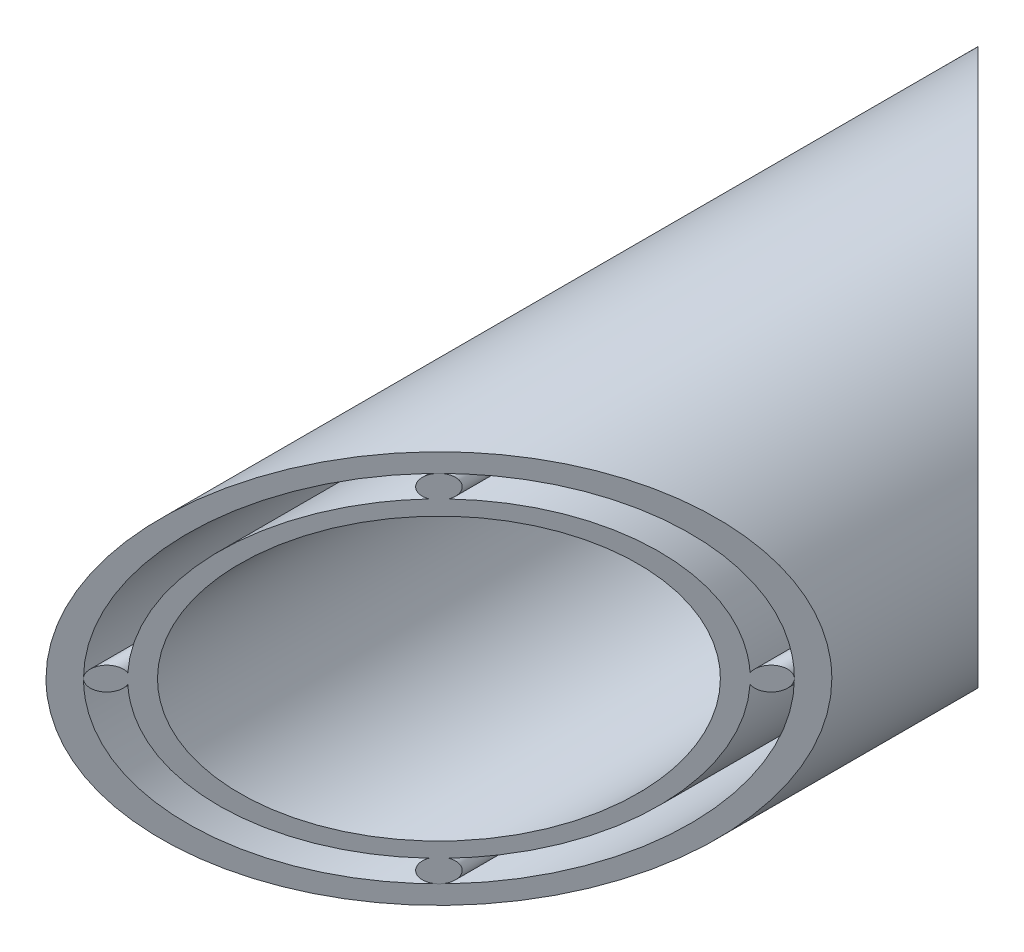
ISO-10303-21;
HEADER;
FILE_DESCRIPTION(('STEP AP214'),'2;1');
FILE_NAME('part.step','',(''),(''),'','','');
FILE_SCHEMA(('AUTOMOTIVE_DESIGN { 1 0 10303 214 1 1 1 1 }'));
ENDSEC;
DATA;
#1=APPLICATION_CONTEXT('core data for automotive mechanical design processes');
#2=APPLICATION_PROTOCOL_DEFINITION('international standard','automotive_design',2000,#1);
#3=PRODUCT_CONTEXT('',#1,'mechanical');
#4=PRODUCT('Part','Part','',(#3));
#5=PRODUCT_RELATED_PRODUCT_CATEGORY('part','',(#4));
#6=PRODUCT_DEFINITION_FORMATION('','',#4);
#7=PRODUCT_DEFINITION_CONTEXT('part definition',#1,'design');
#8=PRODUCT_DEFINITION('design','',#6,#7);
#9=PRODUCT_DEFINITION_SHAPE('','',#8);
#10=(LENGTH_UNIT() NAMED_UNIT(*) SI_UNIT(.MILLI.,.METRE.));
#11=(NAMED_UNIT(*) PLANE_ANGLE_UNIT() SI_UNIT($,.RADIAN.));
#12=(NAMED_UNIT(*) SI_UNIT($,.STERADIAN.) SOLID_ANGLE_UNIT());
#13=UNCERTAINTY_MEASURE_WITH_UNIT(LENGTH_MEASURE(1.E-05),#10,'distance_accuracy_value','');
#14=(GEOMETRIC_REPRESENTATION_CONTEXT(3) GLOBAL_UNCERTAINTY_ASSIGNED_CONTEXT((#13)) GLOBAL_UNIT_ASSIGNED_CONTEXT((#10,
#11,#12)) REPRESENTATION_CONTEXT('',''));
#15=CARTESIAN_POINT('',(0.,0.,0.));
#16=DIRECTION('',(0.,0.,1.));
#17=DIRECTION('',(1.,0.,0.));
#18=AXIS2_PLACEMENT_3D('',#15,#16,#17);
#19=CARTESIAN_POINT('',(0.,0.,50.));
#20=DIRECTION('',(0.,0.,-1.));
#21=DIRECTION('',(-1.,0.,0.));
#22=AXIS2_PLACEMENT_3D('',#19,#20,#21);
#23=CYLINDRICAL_SURFACE('',#22,15.1);
#24=CARTESIAN_POINT('',(0.,0.,-28.9200000000002));
#25=DIRECTION('',(-0.707106781186544,0.,0.707106781186551));
#26=DIRECTION('',(-0.707106781186551,0.,-0.707106781186544));
#27=AXIS2_PLACEMENT_3D('',#24,#25,#26);
#28=ELLIPSE('',#27,21.3546247918336,15.1);
#29=CARTESIAN_POINT('',(-15.1,0.,-44.0200000000001));
#30=VERTEX_POINT('',#29);
#31=EDGE_CURVE('E78',#30,#30,#28,.T.);
#32=ORIENTED_EDGE('',*,*,#31,.F.);
#33=EDGE_LOOP('',(#32));
#34=FACE_BOUND('',#33,.T.);
#35=CARTESIAN_POINT('',(0.,0.,28.9200000000002));
#36=DIRECTION('',(-0.707106781186544,0.,-0.707106781186551));
#37=DIRECTION('',(0.707106781186551,0.,-0.707106781186544));
#38=AXIS2_PLACEMENT_3D('',#35,#36,#37);
#39=ELLIPSE('',#38,21.3546247918336,15.1);
#40=CARTESIAN_POINT('',(15.1,0.,13.8200000000004));
#41=VERTEX_POINT('',#40);
#42=EDGE_CURVE('E147',#41,#41,#39,.T.);
#43=ORIENTED_EDGE('',*,*,#42,.F.);
#44=EDGE_LOOP('',(#43));
#45=FACE_BOUND('',#44,.T.);
#46=ADVANCED_FACE('F74',(#34,#45),#23,.F.);
#47=CARTESIAN_POINT('',(-21.08,-25.,50.));
#48=DIRECTION('',(-0.707106781186544,0.,-0.707106781186551));
#49=DIRECTION('',(-0.707106781186551,0.,0.707106781186544));
#50=AXIS2_PLACEMENT_3D('',#47,#48,#49);
#51=PLANE('',#50);
#52=ORIENTED_EDGE('',*,*,#42,.T.);
#53=EDGE_LOOP('',(#52));
#54=FACE_BOUND('',#53,.T.);
#55=CARTESIAN_POINT('',(0.,0.,28.9200000000002));
#56=DIRECTION('',(-0.707106781186544,0.,-0.707106781186551));
#57=DIRECTION('',(0.707106781186551,0.,-0.707106781186544));
#58=AXIS2_PLACEMENT_3D('',#55,#56,#57);
#59=ELLIPSE('',#58,23.6173664916306,16.7);
#60=CARTESIAN_POINT('',(-0.537271772936892,-16.6913552188552,29.4572717729371));
#61=VERTEX_POINT('',#60);
#62=CARTESIAN_POINT('',(-16.6913552188552,-0.53727177293683,45.6113552188553));
#63=VERTEX_POINT('',#62);
#64=EDGE_CURVE('E153',#61,#63,#59,.T.);
#65=ORIENTED_EDGE('',*,*,#64,.F.);
#66=CARTESIAN_POINT('',(0.,-17.82,28.9200000000002));
#67=DIRECTION('',(-0.707106781186544,0.,-0.707106781186551));
#68=DIRECTION('',(0.707106781186551,0.,-0.707106781186544));
#69=AXIS2_PLACEMENT_3D('',#66,#67,#68);
#70=ELLIPSE('',#69,1.76776695296642,1.25000000000004);
#71=CARTESIAN_POINT('',(0.537271772936892,-16.6913552188552,28.3827282270633));
#72=VERTEX_POINT('',#71);
#73=EDGE_CURVE('E218',#72,#61,#70,.T.);
#74=ORIENTED_EDGE('',*,*,#73,.F.);
#75=CARTESIAN_POINT('',(0.,0.,28.9200000000002));
#76=DIRECTION('',(-0.707106781186544,0.,-0.707106781186551));
#77=DIRECTION('',(0.707106781186551,0.,-0.707106781186544));
#78=AXIS2_PLACEMENT_3D('',#75,#76,#77);
#79=ELLIPSE('',#78,23.6173664916306,16.7);
#80=CARTESIAN_POINT('',(16.6913552188552,-0.537271772937067,12.2286447811452));
#81=VERTEX_POINT('',#80);
#82=EDGE_CURVE('E237',#81,#72,#79,.T.);
#83=ORIENTED_EDGE('',*,*,#82,.F.);
#84=CARTESIAN_POINT('',(17.82,-1.86654592374554E-13,11.1000000000004));
#85=DIRECTION('',(-0.707106781186544,0.,-0.707106781186551));
#86=DIRECTION('',(0.707106781186551,0.,-0.707106781186544));
#87=AXIS2_PLACEMENT_3D('',#84,#85,#86);
#88=ELLIPSE('',#87,1.76776695296642,1.25000000000004);
#89=CARTESIAN_POINT('',(16.6913552188552,0.537271772936717,12.2286447811452));
#90=VERTEX_POINT('',#89);
#91=EDGE_CURVE('E240',#90,#81,#88,.T.);
#92=ORIENTED_EDGE('',*,*,#91,.F.);
#93=CARTESIAN_POINT('',(0.,0.,28.9200000000002));
#94=DIRECTION('',(-0.707106781186544,0.,-0.707106781186551));
#95=DIRECTION('',(0.707106781186551,0.,-0.707106781186544));
#96=AXIS2_PLACEMENT_3D('',#93,#94,#95);
#97=ELLIPSE('',#96,23.6173664916306,16.7);
#98=CARTESIAN_POINT('',(0.53727177293711,16.6913552188552,28.3827282270631));
#99=VERTEX_POINT('',#98);
#100=EDGE_CURVE('E243',#99,#90,#97,.T.);
#101=ORIENTED_EDGE('',*,*,#100,.F.);
#102=CARTESIAN_POINT('',(1.24653235350866E-13,17.82,28.9200000000001));
#103=DIRECTION('',(-0.707106781186544,0.,-0.707106781186551));
#104=DIRECTION('',(0.707106781186551,0.,-0.707106781186544));
#105=AXIS2_PLACEMENT_3D('',#102,#103,#104);
#106=ELLIPSE('',#105,1.76776695296642,1.25000000000004);
#107=CARTESIAN_POINT('',(-0.537271772936876,16.6913552188552,29.4572717729371));
#108=VERTEX_POINT('',#107);
#109=EDGE_CURVE('E91',#108,#99,#106,.T.);
#110=ORIENTED_EDGE('',*,*,#109,.F.);
#111=CARTESIAN_POINT('',(0.,0.,28.9200000000002));
#112=DIRECTION('',(-0.707106781186544,0.,-0.707106781186551));
#113=DIRECTION('',(0.707106781186551,0.,-0.707106781186544));
#114=AXIS2_PLACEMENT_3D('',#111,#112,#113);
#115=ELLIPSE('',#114,23.6173664916306,16.7);
#116=CARTESIAN_POINT('',(-16.6913552188552,0.537271772936954,45.6113552188553));
#117=VERTEX_POINT('',#116);
#118=EDGE_CURVE('E138',#117,#108,#115,.T.);
#119=ORIENTED_EDGE('',*,*,#118,.F.);
#120=CARTESIAN_POINT('',(-17.82,0.,46.74));
#121=DIRECTION('',(-0.707106781186544,0.,-0.707106781186551));
#122=DIRECTION('',(0.707106781186551,0.,-0.707106781186544));
#123=AXIS2_PLACEMENT_3D('',#120,#121,#122);
#124=ELLIPSE('',#123,1.76776695296642,1.25000000000004);
#125=EDGE_CURVE('E141',#63,#117,#124,.T.);
#126=ORIENTED_EDGE('',*,*,#125,.F.);
#127=EDGE_LOOP('',(#65,#74,#83,#92,#101,#110,#119,#126));
#128=FACE_BOUND('',#127,.T.);
#129=ADVANCED_FACE('F140',(#54,#128),#51,.F.);
#130=CARTESIAN_POINT('',(-21.08,-25.,-50.));
#131=DIRECTION('',(-0.707106781186544,0.,0.707106781186551));
#132=DIRECTION('',(0.707106781186551,0.,0.707106781186544));
#133=AXIS2_PLACEMENT_3D('',#130,#131,#132);
#134=PLANE('',#133);
#135=ORIENTED_EDGE('',*,*,#31,.T.);
#136=EDGE_LOOP('',(#135));
#137=FACE_BOUND('',#136,.T.);
#138=CARTESIAN_POINT('',(0.,0.,-28.9200000000002));
#139=DIRECTION('',(-0.707106781186544,0.,0.707106781186551));
#140=DIRECTION('',(-0.707106781186551,0.,-0.707106781186544));
#141=AXIS2_PLACEMENT_3D('',#138,#139,#140);
#142=ELLIPSE('',#141,23.6173664916306,16.7);
#143=CARTESIAN_POINT('',(-0.537271772936876,16.6913552188552,-29.4572717729371));
#144=VERTEX_POINT('',#143);
#145=CARTESIAN_POINT('',(-16.6913552188552,0.537271772936954,-45.6113552188553));
#146=VERTEX_POINT('',#145);
#147=EDGE_CURVE('E156',#144,#146,#142,.T.);
#148=ORIENTED_EDGE('',*,*,#147,.F.);
#149=CARTESIAN_POINT('',(1.24653235350866E-13,17.82,-28.9200000000001));
#150=DIRECTION('',(-0.707106781186544,0.,0.707106781186551));
#151=DIRECTION('',(-0.707106781186551,0.,-0.707106781186544));
#152=AXIS2_PLACEMENT_3D('',#149,#150,#151);
#153=ELLIPSE('',#152,1.76776695296642,1.25000000000004);
#154=CARTESIAN_POINT('',(0.53727177293711,16.6913552188552,-28.3827282270631));
#155=VERTEX_POINT('',#154);
#156=EDGE_CURVE('E231',#155,#144,#153,.T.);
#157=ORIENTED_EDGE('',*,*,#156,.F.);
#158=CARTESIAN_POINT('',(0.,0.,-28.9200000000002));
#159=DIRECTION('',(-0.707106781186544,0.,0.707106781186551));
#160=DIRECTION('',(-0.707106781186551,0.,-0.707106781186544));
#161=AXIS2_PLACEMENT_3D('',#158,#159,#160);
#162=ELLIPSE('',#161,23.6173664916306,16.7);
#163=CARTESIAN_POINT('',(16.6913552188552,0.537271772936717,-12.2286447811452));
#164=VERTEX_POINT('',#163);
#165=EDGE_CURVE('E228',#164,#155,#162,.T.);
#166=ORIENTED_EDGE('',*,*,#165,.F.);
#167=CARTESIAN_POINT('',(17.82,-1.86654592374554E-13,-11.1000000000004));
#168=DIRECTION('',(-0.707106781186544,0.,0.707106781186551));
#169=DIRECTION('',(-0.707106781186551,0.,-0.707106781186544));
#170=AXIS2_PLACEMENT_3D('',#167,#168,#169);
#171=ELLIPSE('',#170,1.76776695296642,1.25000000000004);
#172=CARTESIAN_POINT('',(16.6913552188552,-0.537271772937067,-12.2286447811452));
#173=VERTEX_POINT('',#172);
#174=EDGE_CURVE('E225',#173,#164,#171,.T.);
#175=ORIENTED_EDGE('',*,*,#174,.F.);
#176=CARTESIAN_POINT('',(0.,0.,-28.9200000000002));
#177=DIRECTION('',(-0.707106781186544,0.,0.707106781186551));
#178=DIRECTION('',(-0.707106781186551,0.,-0.707106781186544));
#179=AXIS2_PLACEMENT_3D('',#176,#177,#178);
#180=ELLIPSE('',#179,23.6173664916306,16.7);
#181=CARTESIAN_POINT('',(0.537271772936892,-16.6913552188552,-28.3827282270633));
#182=VERTEX_POINT('',#181);
#183=EDGE_CURVE('E220',#182,#173,#180,.T.);
#184=ORIENTED_EDGE('',*,*,#183,.F.);
#185=CARTESIAN_POINT('',(0.,-17.82,-28.9200000000002));
#186=DIRECTION('',(-0.707106781186544,0.,0.707106781186551));
#187=DIRECTION('',(-0.707106781186551,0.,-0.707106781186544));
#188=AXIS2_PLACEMENT_3D('',#185,#186,#187);
#189=ELLIPSE('',#188,1.76776695296642,1.25000000000004);
#190=CARTESIAN_POINT('',(-0.537271772936892,-16.6913552188552,-29.4572717729371));
#191=VERTEX_POINT('',#190);
#192=EDGE_CURVE('E217',#191,#182,#189,.T.);
#193=ORIENTED_EDGE('',*,*,#192,.F.);
#194=CARTESIAN_POINT('',(0.,0.,-28.9200000000002));
#195=DIRECTION('',(-0.707106781186544,0.,0.707106781186551));
#196=DIRECTION('',(-0.707106781186551,0.,-0.707106781186544));
#197=AXIS2_PLACEMENT_3D('',#194,#195,#196);
#198=ELLIPSE('',#197,23.6173664916306,16.7);
#199=CARTESIAN_POINT('',(-16.6913552188552,-0.53727177293683,-45.6113552188553));
#200=VERTEX_POINT('',#199);
#201=EDGE_CURVE('E161',#200,#191,#198,.T.);
#202=ORIENTED_EDGE('',*,*,#201,.F.);
#203=CARTESIAN_POINT('',(-17.82,0.,-46.74));
#204=DIRECTION('',(-0.707106781186544,0.,0.707106781186551));
#205=DIRECTION('',(-0.707106781186551,0.,-0.707106781186544));
#206=AXIS2_PLACEMENT_3D('',#203,#204,#205);
#207=ELLIPSE('',#206,1.76776695296642,1.25000000000004);
#208=EDGE_CURVE('E99',#146,#200,#207,.T.);
#209=ORIENTED_EDGE('',*,*,#208,.F.);
#210=EDGE_LOOP('',(#148,#157,#166,#175,#184,#193,#202,#209));
#211=FACE_BOUND('',#210,.T.);
#212=ADVANCED_FACE('F187',(#137,#211),#134,.F.);
#213=CARTESIAN_POINT('',(-17.82,0.,50.));
#214=DIRECTION('',(0.,0.,-1.));
#215=DIRECTION('',(-1.,0.,0.));
#216=AXIS2_PLACEMENT_3D('',#213,#214,#215);
#217=CYLINDRICAL_SURFACE('',#216,1.25000000000004);
#218=DIRECTION('',(0.,0.,-1.));
#219=VECTOR('',#218,1.);
#220=CARTESIAN_POINT('',(-16.6913552188552,0.537271772936954,50.));
#221=LINE('',#220,#219);
#222=EDGE_CURVE('E152',#117,#146,#221,.T.);
#223=ORIENTED_EDGE('',*,*,#222,.T.);
#224=ORIENTED_EDGE('',*,*,#208,.T.);
#225=DIRECTION('',(0.,0.,-1.));
#226=VECTOR('',#225,1.);
#227=CARTESIAN_POINT('',(-16.6913552188552,-0.53727177293683,50.));
#228=LINE('',#227,#226);
#229=EDGE_CURVE('E13',#63,#200,#228,.T.);
#230=ORIENTED_EDGE('',*,*,#229,.F.);
#231=ORIENTED_EDGE('',*,*,#125,.T.);
#232=EDGE_LOOP('',(#223,#224,#230,#231));
#233=FACE_BOUND('',#232,.T.);
#234=ADVANCED_FACE('F76',(#233),#217,.T.);
#235=CARTESIAN_POINT('',(0.,0.,50.));
#236=DIRECTION('',(0.,0.,-1.));
#237=DIRECTION('',(-1.,0.,0.));
#238=AXIS2_PLACEMENT_3D('',#235,#236,#237);
#239=CYLINDRICAL_SURFACE('',#238,16.7);
#240=ORIENTED_EDGE('',*,*,#229,.T.);
#241=ORIENTED_EDGE('',*,*,#201,.T.);
#242=DIRECTION('',(0.,0.,-1.));
#243=VECTOR('',#242,1.);
#244=CARTESIAN_POINT('',(-0.537271772936892,-16.6913552188552,50.));
#245=LINE('',#244,#243);
#246=EDGE_CURVE('E83',#61,#191,#245,.T.);
#247=ORIENTED_EDGE('',*,*,#246,.F.);
#248=ORIENTED_EDGE('',*,*,#64,.T.);
#249=EDGE_LOOP('',(#240,#241,#247,#248));
#250=FACE_BOUND('',#249,.T.);
#251=ADVANCED_FACE('F195',(#250),#239,.T.);
#252=CARTESIAN_POINT('',(0.,-17.82,50.));
#253=DIRECTION('',(0.,0.,-1.));
#254=DIRECTION('',(-1.,0.,0.));
#255=AXIS2_PLACEMENT_3D('',#252,#253,#254);
#256=CYLINDRICAL_SURFACE('',#255,1.25000000000004);
#257=ORIENTED_EDGE('',*,*,#246,.T.);
#258=ORIENTED_EDGE('',*,*,#192,.T.);
#259=DIRECTION('',(0.,0.,-1.));
#260=VECTOR('',#259,1.);
#261=CARTESIAN_POINT('',(0.537271772936892,-16.6913552188552,50.));
#262=LINE('',#261,#260);
#263=EDGE_CURVE('E173',#72,#182,#262,.T.);
#264=ORIENTED_EDGE('',*,*,#263,.F.);
#265=ORIENTED_EDGE('',*,*,#73,.T.);
#266=EDGE_LOOP('',(#257,#258,#264,#265));
#267=FACE_BOUND('',#266,.T.);
#268=ADVANCED_FACE('F204',(#267),#256,.T.);
#269=ORIENTED_EDGE('',*,*,#263,.T.);
#270=ORIENTED_EDGE('',*,*,#183,.T.);
#271=DIRECTION('',(0.,0.,-1.));
#272=VECTOR('',#271,1.);
#273=CARTESIAN_POINT('',(16.6913552188552,-0.537271772937067,50.));
#274=LINE('',#273,#272);
#275=EDGE_CURVE('E170',#81,#173,#274,.T.);
#276=ORIENTED_EDGE('',*,*,#275,.F.);
#277=ORIENTED_EDGE('',*,*,#82,.T.);
#278=EDGE_LOOP('',(#269,#270,#276,#277));
#279=FACE_BOUND('',#278,.T.);
#280=ADVANCED_FACE('F202',(#279),#239,.T.);
#281=CARTESIAN_POINT('',(17.82,-1.86654592374554E-13,50.));
#282=DIRECTION('',(0.,0.,-1.));
#283=DIRECTION('',(-1.,0.,0.));
#284=AXIS2_PLACEMENT_3D('',#281,#282,#283);
#285=CYLINDRICAL_SURFACE('',#284,1.25000000000004);
#286=ORIENTED_EDGE('',*,*,#275,.T.);
#287=ORIENTED_EDGE('',*,*,#174,.T.);
#288=DIRECTION('',(0.,0.,-1.));
#289=VECTOR('',#288,1.);
#290=CARTESIAN_POINT('',(16.6913552188552,0.537271772936717,50.));
#291=LINE('',#290,#289);
#292=EDGE_CURVE('E167',#90,#164,#291,.T.);
#293=ORIENTED_EDGE('',*,*,#292,.F.);
#294=ORIENTED_EDGE('',*,*,#91,.T.);
#295=EDGE_LOOP('',(#286,#287,#293,#294));
#296=FACE_BOUND('',#295,.T.);
#297=ADVANCED_FACE('F200',(#296),#285,.T.);
#298=ORIENTED_EDGE('',*,*,#292,.T.);
#299=ORIENTED_EDGE('',*,*,#165,.T.);
#300=DIRECTION('',(0.,0.,-1.));
#301=VECTOR('',#300,1.);
#302=CARTESIAN_POINT('',(0.53727177293711,16.6913552188552,50.));
#303=LINE('',#302,#301);
#304=EDGE_CURVE('E159',#99,#155,#303,.T.);
#305=ORIENTED_EDGE('',*,*,#304,.F.);
#306=ORIENTED_EDGE('',*,*,#100,.T.);
#307=EDGE_LOOP('',(#298,#299,#305,#306));
#308=FACE_BOUND('',#307,.T.);
#309=ADVANCED_FACE('F196',(#308),#239,.T.);
#310=CARTESIAN_POINT('',(1.24653235350866E-13,17.82,50.));
#311=DIRECTION('',(0.,0.,-1.));
#312=DIRECTION('',(-1.,0.,0.));
#313=AXIS2_PLACEMENT_3D('',#310,#311,#312);
#314=CYLINDRICAL_SURFACE('',#313,1.25000000000004);
#315=ORIENTED_EDGE('',*,*,#304,.T.);
#316=ORIENTED_EDGE('',*,*,#156,.T.);
#317=DIRECTION('',(0.,0.,-1.));
#318=VECTOR('',#317,1.);
#319=CARTESIAN_POINT('',(-0.537271772936876,16.6913552188552,50.));
#320=LINE('',#319,#318);
#321=EDGE_CURVE('E157',#108,#144,#320,.T.);
#322=ORIENTED_EDGE('',*,*,#321,.F.);
#323=ORIENTED_EDGE('',*,*,#109,.T.);
#324=EDGE_LOOP('',(#315,#316,#322,#323));
#325=FACE_BOUND('',#324,.T.);
#326=ADVANCED_FACE('F194',(#325),#314,.T.);
#327=ORIENTED_EDGE('',*,*,#321,.T.);
#328=ORIENTED_EDGE('',*,*,#147,.T.);
#329=ORIENTED_EDGE('',*,*,#222,.F.);
#330=ORIENTED_EDGE('',*,*,#118,.T.);
#331=EDGE_LOOP('',(#327,#328,#329,#330));
#332=FACE_BOUND('',#331,.T.);
#333=ADVANCED_FACE('F155',(#332),#239,.T.);
#334=CLOSED_SHELL('',(#46,#129,#212,#234,#251,#268,#280,#297,#309,#326,#333));
#335=MANIFOLD_SOLID_BREP('B2',#334);
#336=CARTESIAN_POINT('',(0.,0.,50.));
#337=DIRECTION('',(0.,0.,-1.));
#338=DIRECTION('',(-1.,0.,0.));
#339=AXIS2_PLACEMENT_3D('',#336,#337,#338);
#340=CYLINDRICAL_SURFACE('',#339,21.08);
#341=CARTESIAN_POINT('',(0.,0.,28.9200000000002));
#342=DIRECTION('',(-0.707106781186544,0.,-0.707106781186551));
#343=DIRECTION('',(0.707106781186551,0.,-0.707106781186544));
#344=AXIS2_PLACEMENT_3D('',#341,#342,#343);
#345=ELLIPSE('',#344,29.8116218948247,21.08);
#346=CARTESIAN_POINT('',(21.08,0.,7.84000000000047));
#347=VERTEX_POINT('',#346);
#348=EDGE_CURVE('E328',#347,#347,#345,.T.);
#349=ORIENTED_EDGE('',*,*,#348,.T.);
#350=EDGE_LOOP('',(#349));
#351=FACE_BOUND('',#350,.T.);
#352=CARTESIAN_POINT('',(0.,0.,-28.9200000000002));
#353=DIRECTION('',(-0.707106781186544,0.,0.707106781186551));
#354=DIRECTION('',(-0.707106781186551,0.,-0.707106781186544));
#355=AXIS2_PLACEMENT_3D('',#352,#353,#354);
#356=ELLIPSE('',#355,29.8116218948247,21.08);
#357=CARTESIAN_POINT('',(-21.08,0.,-50.));
#358=VERTEX_POINT('',#357);
#359=EDGE_CURVE('E338',#358,#358,#356,.T.);
#360=ORIENTED_EDGE('',*,*,#359,.T.);
#361=EDGE_LOOP('',(#360));
#362=FACE_BOUND('',#361,.T.);
#363=ADVANCED_FACE('F320',(#351,#362),#340,.T.);
#364=CARTESIAN_POINT('',(-21.08,-25.,50.));
#365=DIRECTION('',(-0.707106781186544,0.,-0.707106781186551));
#366=DIRECTION('',(-0.707106781186551,0.,0.707106781186544));
#367=AXIS2_PLACEMENT_3D('',#364,#365,#366);
#368=PLANE('',#367);
#369=CARTESIAN_POINT('',(0.,0.,28.9200000000002));
#370=DIRECTION('',(-0.707106781186544,0.,-0.707106781186551));
#371=DIRECTION('',(0.707106781186551,0.,-0.707106781186544));
#372=AXIS2_PLACEMENT_3D('',#369,#370,#371);
#373=ELLIPSE('',#372,26.9690526344548,19.07);
#374=CARTESIAN_POINT('',(19.07,0.,9.85000000000045));
#375=VERTEX_POINT('',#374);
#376=EDGE_CURVE('E73',#375,#375,#373,.T.);
#377=ORIENTED_EDGE('',*,*,#376,.T.);
#378=EDGE_LOOP('',(#377));
#379=FACE_BOUND('',#378,.T.);
#380=ORIENTED_EDGE('',*,*,#348,.F.);
#381=EDGE_LOOP('',(#380));
#382=FACE_BOUND('',#381,.T.);
#383=ADVANCED_FACE('F348',(#379,#382),#368,.F.);
#384=CARTESIAN_POINT('',(-21.08,-25.,-50.));
#385=DIRECTION('',(-0.707106781186544,0.,0.707106781186551));
#386=DIRECTION('',(0.707106781186551,0.,0.707106781186544));
#387=AXIS2_PLACEMENT_3D('',#384,#385,#386);
#388=PLANE('',#387);
#389=CARTESIAN_POINT('',(0.,0.,-28.9200000000002));
#390=DIRECTION('',(-0.707106781186544,0.,0.707106781186551));
#391=DIRECTION('',(-0.707106781186551,0.,-0.707106781186544));
#392=AXIS2_PLACEMENT_3D('',#389,#390,#391);
#393=ELLIPSE('',#392,26.9690526344548,19.07);
#394=CARTESIAN_POINT('',(-19.07,0.,-47.99));
#395=VERTEX_POINT('',#394);
#396=EDGE_CURVE('E333',#395,#395,#393,.T.);
#397=ORIENTED_EDGE('',*,*,#396,.T.);
#398=EDGE_LOOP('',(#397));
#399=FACE_BOUND('',#398,.T.);
#400=ORIENTED_EDGE('',*,*,#359,.F.);
#401=EDGE_LOOP('',(#400));
#402=FACE_BOUND('',#401,.T.);
#403=ADVANCED_FACE('F346',(#399,#402),#388,.F.);
#404=CARTESIAN_POINT('',(0.,0.,50.));
#405=DIRECTION('',(0.,0.,-1.));
#406=DIRECTION('',(-1.,0.,0.));
#407=AXIS2_PLACEMENT_3D('',#404,#405,#406);
#408=CYLINDRICAL_SURFACE('',#407,19.07);
#409=ORIENTED_EDGE('',*,*,#396,.F.);
#410=EDGE_LOOP('',(#409));
#411=FACE_BOUND('',#410,.T.);
#412=ORIENTED_EDGE('',*,*,#376,.F.);
#413=EDGE_LOOP('',(#412));
#414=FACE_BOUND('',#413,.T.);
#415=ADVANCED_FACE('F322',(#411,#414),#408,.F.);
#416=CLOSED_SHELL('',(#363,#383,#403,#415));
#417=MANIFOLD_SOLID_BREP('B7',#416);
#418=ADVANCED_BREP_SHAPE_REPRESENTATION('',(#18,#335,#417),#14);
#419=SHAPE_DEFINITION_REPRESENTATION(#9,#418);
ENDSEC;
END-ISO-10303-21;
